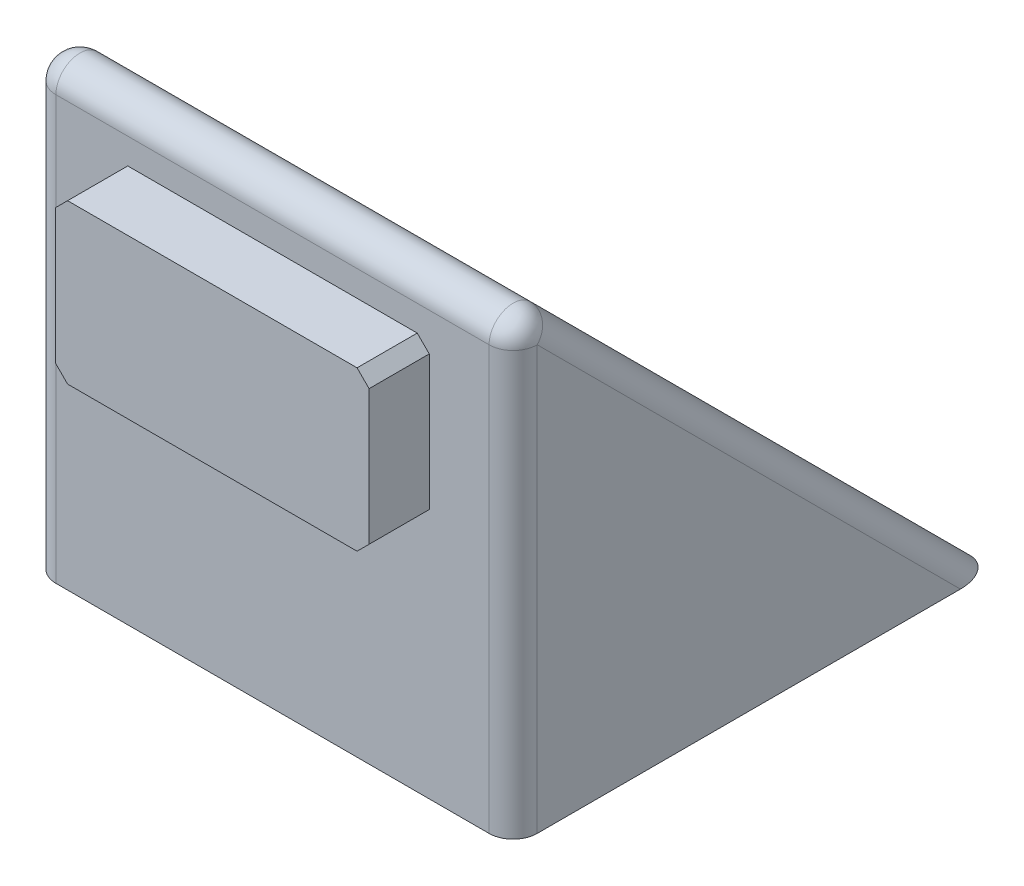
ISO-10303-21;
HEADER;
FILE_DESCRIPTION(('STEP AP214'),'2;1');
FILE_NAME('part.step','',(''),(''),'','','');
FILE_SCHEMA(('AUTOMOTIVE_DESIGN { 1 0 10303 214 1 1 1 1 }'));
ENDSEC;
DATA;
#1=APPLICATION_CONTEXT('core data for automotive mechanical design processes');
#2=APPLICATION_PROTOCOL_DEFINITION('international standard','automotive_design',2000,#1);
#3=PRODUCT_CONTEXT('',#1,'mechanical');
#4=PRODUCT('Part','Part','',(#3));
#5=PRODUCT_RELATED_PRODUCT_CATEGORY('part','',(#4));
#6=PRODUCT_DEFINITION_FORMATION('','',#4);
#7=PRODUCT_DEFINITION_CONTEXT('part definition',#1,'design');
#8=PRODUCT_DEFINITION('design','',#6,#7);
#9=PRODUCT_DEFINITION_SHAPE('','',#8);
#10=(LENGTH_UNIT() NAMED_UNIT(*) SI_UNIT(.MILLI.,.METRE.));
#11=(NAMED_UNIT(*) PLANE_ANGLE_UNIT() SI_UNIT($,.RADIAN.));
#12=(NAMED_UNIT(*) SI_UNIT($,.STERADIAN.) SOLID_ANGLE_UNIT());
#13=UNCERTAINTY_MEASURE_WITH_UNIT(LENGTH_MEASURE(1.E-05),#10,'distance_accuracy_value','');
#14=(GEOMETRIC_REPRESENTATION_CONTEXT(3) GLOBAL_UNCERTAINTY_ASSIGNED_CONTEXT((#13)) GLOBAL_UNIT_ASSIGNED_CONTEXT((#10,
#11,#12)) REPRESENTATION_CONTEXT('',''));
#15=CARTESIAN_POINT('',(0.,0.,0.));
#16=DIRECTION('',(0.,0.,1.));
#17=DIRECTION('',(1.,0.,0.));
#18=AXIS2_PLACEMENT_3D('',#15,#16,#17);
#19=CARTESIAN_POINT('',(-20.,40.,0.));
#20=DIRECTION('',(0.,0.,1.));
#21=DIRECTION('',(0.,-1.,0.));
#22=AXIS2_PLACEMENT_3D('',#19,#20,#21);
#23=PLANE('',#22);
#24=DIRECTION('',(0.,-1.,0.));
#25=VECTOR('',#24,1.);
#26=CARTESIAN_POINT('',(18.,40.,0.));
#27=LINE('',#26,#25);
#28=CARTESIAN_POINT('',(18.,0.,0.));
#29=VERTEX_POINT('',#28);
#30=CARTESIAN_POINT('',(18.,35.1715728752538,0.));
#31=VERTEX_POINT('',#30);
#32=EDGE_CURVE('E213',#29,#31,#27,.F.);
#33=ORIENTED_EDGE('',*,*,#32,.T.);
#34=DIRECTION('',(1.,0.,0.));
#35=VECTOR('',#34,1.);
#36=CARTESIAN_POINT('',(-20.,35.1715728752538,0.));
#37=LINE('',#36,#35);
#38=CARTESIAN_POINT('',(-18.,35.1715728752538,0.));
#39=VERTEX_POINT('',#38);
#40=EDGE_CURVE('E11',#31,#39,#37,.F.);
#41=ORIENTED_EDGE('',*,*,#40,.T.);
#42=DIRECTION('',(0.,-1.,0.));
#43=VECTOR('',#42,1.);
#44=CARTESIAN_POINT('',(-18.,0.,0.));
#45=LINE('',#44,#43);
#46=CARTESIAN_POINT('',(-18.,0.,0.));
#47=VERTEX_POINT('',#46);
#48=EDGE_CURVE('E211',#39,#47,#45,.T.);
#49=ORIENTED_EDGE('',*,*,#48,.T.);
#50=DIRECTION('',(1.,0.,0.));
#51=VECTOR('',#50,1.);
#52=CARTESIAN_POINT('',(-20.,0.,0.));
#53=LINE('',#52,#51);
#54=EDGE_CURVE('E183',#47,#29,#53,.T.);
#55=ORIENTED_EDGE('',*,*,#54,.T.);
#56=EDGE_LOOP('',(#33,#41,#49,#55));
#57=FACE_BOUND('',#56,.T.);
#58=DIRECTION('',(-0.707106781186547,-0.707106781186547,0.));
#59=VECTOR('',#58,1.);
#60=CARTESIAN_POINT('',(-13.0285883481844,32.0285883481845,0.));
#61=LINE('',#60,#59);
#62=CARTESIAN_POINT('',(-12.0285883481844,33.0285883481845,0.));
#63=VERTEX_POINT('',#62);
#64=CARTESIAN_POINT('',(-13.0285883481844,32.0285883481845,0.));
#65=VERTEX_POINT('',#64);
#66=EDGE_CURVE('E232',#63,#65,#61,.T.);
#67=ORIENTED_EDGE('',*,*,#66,.F.);
#68=DIRECTION('',(-1.,0.,0.));
#69=VECTOR('',#68,1.);
#70=CARTESIAN_POINT('',(-12.0285883481844,33.0285883481845,0.));
#71=LINE('',#70,#69);
#72=CARTESIAN_POINT('',(12.0285883481844,33.0285883481845,0.));
#73=VERTEX_POINT('',#72);
#74=EDGE_CURVE('E170',#73,#63,#71,.T.);
#75=ORIENTED_EDGE('',*,*,#74,.F.);
#76=DIRECTION('',(-0.707106781186547,0.707106781186547,0.));
#77=VECTOR('',#76,1.);
#78=CARTESIAN_POINT('',(12.0285883481844,33.0285883481845,0.));
#79=LINE('',#78,#77);
#80=CARTESIAN_POINT('',(13.0285883481844,32.0285883481845,0.));
#81=VERTEX_POINT('',#80);
#82=EDGE_CURVE('E166',#81,#73,#79,.T.);
#83=ORIENTED_EDGE('',*,*,#82,.F.);
#84=DIRECTION('',(0.,1.,0.));
#85=VECTOR('',#84,1.);
#86=CARTESIAN_POINT('',(13.0285883481844,32.0285883481845,0.));
#87=LINE('',#86,#85);
#88=CARTESIAN_POINT('',(13.0285883481844,20.8278160130197,0.));
#89=VERTEX_POINT('',#88);
#90=EDGE_CURVE('E246',#89,#81,#87,.T.);
#91=ORIENTED_EDGE('',*,*,#90,.F.);
#92=DIRECTION('',(0.707106781186547,0.707106781186547,0.));
#93=VECTOR('',#92,1.);
#94=CARTESIAN_POINT('',(13.0285883481844,20.8278160130197,0.));
#95=LINE('',#94,#93);
#96=CARTESIAN_POINT('',(12.0285883481844,19.8278160130197,0.));
#97=VERTEX_POINT('',#96);
#98=EDGE_CURVE('E244',#97,#89,#95,.T.);
#99=ORIENTED_EDGE('',*,*,#98,.F.);
#100=DIRECTION('',(1.,0.,0.));
#101=VECTOR('',#100,1.);
#102=CARTESIAN_POINT('',(-12.0285883481844,19.8278160130197,0.));
#103=LINE('',#102,#101);
#104=CARTESIAN_POINT('',(-12.0285883481844,19.8278160130197,0.));
#105=VERTEX_POINT('',#104);
#106=EDGE_CURVE('E242',#105,#97,#103,.T.);
#107=ORIENTED_EDGE('',*,*,#106,.F.);
#108=DIRECTION('',(0.707106781186547,-0.707106781186547,0.));
#109=VECTOR('',#108,1.);
#110=CARTESIAN_POINT('',(-13.0285883481844,20.8278160130197,0.));
#111=LINE('',#110,#109);
#112=CARTESIAN_POINT('',(-13.0285883481844,20.8278160130197,0.));
#113=VERTEX_POINT('',#112);
#114=EDGE_CURVE('E240',#113,#105,#111,.T.);
#115=ORIENTED_EDGE('',*,*,#114,.F.);
#116=DIRECTION('',(0.,-1.,0.));
#117=VECTOR('',#116,1.);
#118=CARTESIAN_POINT('',(-13.0285883481844,32.0285883481845,0.));
#119=LINE('',#118,#117);
#120=EDGE_CURVE('E234',#65,#113,#119,.T.);
#121=ORIENTED_EDGE('',*,*,#120,.F.);
#122=EDGE_LOOP('',(#67,#75,#83,#91,#99,#107,#115,#121));
#123=FACE_BOUND('',#122,.T.);
#124=ADVANCED_FACE('F37',(#57,#123),#23,.T.);
#125=CARTESIAN_POINT('',(-20.,0.,-40.));
#126=DIRECTION('',(0.,0.707106781186548,-0.707106781186548));
#127=DIRECTION('',(0.,0.707106781186548,0.707106781186548));
#128=AXIS2_PLACEMENT_3D('',#125,#126,#127);
#129=PLANE('',#128);
#130=DIRECTION('',(0.,0.707106781186548,0.707106781186548));
#131=VECTOR('',#130,1.);
#132=CARTESIAN_POINT('',(-18.,40.,0.));
#133=LINE('',#132,#131);
#134=CARTESIAN_POINT('',(-18.,0.,-40.));
#135=VERTEX_POINT('',#134);
#136=CARTESIAN_POINT('',(-18.,36.5857864376269,-3.4142135623731));
#137=VERTEX_POINT('',#136);
#138=EDGE_CURVE('E194',#135,#137,#133,.T.);
#139=ORIENTED_EDGE('',*,*,#138,.T.);
#140=DIRECTION('',(1.,0.,0.));
#141=VECTOR('',#140,1.);
#142=CARTESIAN_POINT('',(-20.,36.5857864376269,-3.4142135623731));
#143=LINE('',#142,#141);
#144=CARTESIAN_POINT('',(18.,36.5857864376269,-3.41421356237309));
#145=VERTEX_POINT('',#144);
#146=EDGE_CURVE('E46',#137,#145,#143,.T.);
#147=ORIENTED_EDGE('',*,*,#146,.T.);
#148=DIRECTION('',(0.,0.707106781186548,0.707106781186548));
#149=VECTOR('',#148,1.);
#150=CARTESIAN_POINT('',(18.,0.,-40.));
#151=LINE('',#150,#149);
#152=CARTESIAN_POINT('',(18.,0.,-40.));
#153=VERTEX_POINT('',#152);
#154=EDGE_CURVE('E196',#145,#153,#151,.F.);
#155=ORIENTED_EDGE('',*,*,#154,.T.);
#156=DIRECTION('',(1.,0.,0.));
#157=VECTOR('',#156,1.);
#158=CARTESIAN_POINT('',(-20.,0.,-40.));
#159=LINE('',#158,#157);
#160=EDGE_CURVE('E184',#135,#153,#159,.T.);
#161=ORIENTED_EDGE('',*,*,#160,.F.);
#162=EDGE_LOOP('',(#139,#147,#155,#161));
#163=FACE_BOUND('',#162,.T.);
#164=ADVANCED_FACE('F302',(#163),#129,.T.);
#165=CARTESIAN_POINT('',(-20.,0.,0.));
#166=DIRECTION('',(0.,-1.,0.));
#167=DIRECTION('',(0.,0.,-1.));
#168=AXIS2_PLACEMENT_3D('',#165,#166,#167);
#169=PLANE('',#168);
#170=ORIENTED_EDGE('',*,*,#160,.T.);
#171=CARTESIAN_POINT('',(18.,0.,-37.1715728752538));
#172=DIRECTION('',(0.,-1.,0.));
#173=DIRECTION('',(0.,0.,1.));
#174=AXIS2_PLACEMENT_3D('',#171,#172,#173);
#175=ELLIPSE('',#174,2.82842712474619,2.);
#176=CARTESIAN_POINT('',(20.,0.,-37.1715728752538));
#177=VERTEX_POINT('',#176);
#178=EDGE_CURVE('E204',#153,#177,#175,.T.);
#179=ORIENTED_EDGE('',*,*,#178,.T.);
#180=DIRECTION('',(0.,0.,-1.));
#181=VECTOR('',#180,1.);
#182=CARTESIAN_POINT('',(20.,0.,0.));
#183=LINE('',#182,#181);
#184=CARTESIAN_POINT('',(20.,0.,-2.));
#185=VERTEX_POINT('',#184);
#186=EDGE_CURVE('E172',#185,#177,#183,.T.);
#187=ORIENTED_EDGE('',*,*,#186,.F.);
#188=CARTESIAN_POINT('',(18.,0.,-2.));
#189=DIRECTION('',(0.,-1.,0.));
#190=DIRECTION('',(0.,0.,-1.));
#191=AXIS2_PLACEMENT_3D('',#188,#189,#190);
#192=CIRCLE('',#191,2.);
#193=EDGE_CURVE('E200',#185,#29,#192,.T.);
#194=ORIENTED_EDGE('',*,*,#193,.T.);
#195=ORIENTED_EDGE('',*,*,#54,.F.);
#196=CARTESIAN_POINT('',(-18.,0.,-2.));
#197=DIRECTION('',(0.,-1.,0.));
#198=DIRECTION('',(0.,0.,-1.));
#199=AXIS2_PLACEMENT_3D('',#196,#197,#198);
#200=CIRCLE('',#199,2.);
#201=CARTESIAN_POINT('',(-20.,0.,-2.));
#202=VERTEX_POINT('',#201);
#203=EDGE_CURVE('E198',#47,#202,#200,.T.);
#204=ORIENTED_EDGE('',*,*,#203,.T.);
#205=DIRECTION('',(0.,0.,-1.));
#206=VECTOR('',#205,1.);
#207=CARTESIAN_POINT('',(-20.,0.,0.));
#208=LINE('',#207,#206);
#209=CARTESIAN_POINT('',(-20.,0.,-37.1715728752538));
#210=VERTEX_POINT('',#209);
#211=EDGE_CURVE('E175',#202,#210,#208,.T.);
#212=ORIENTED_EDGE('',*,*,#211,.T.);
#213=CARTESIAN_POINT('',(-18.,0.,-37.1715728752538));
#214=DIRECTION('',(0.,-1.,0.));
#215=DIRECTION('',(0.,0.,-1.));
#216=AXIS2_PLACEMENT_3D('',#213,#214,#215);
#217=ELLIPSE('',#216,2.82842712474619,2.);
#218=EDGE_CURVE('E202',#210,#135,#217,.T.);
#219=ORIENTED_EDGE('',*,*,#218,.T.);
#220=EDGE_LOOP('',(#170,#179,#187,#194,#195,#204,#212,#219));
#221=FACE_BOUND('',#220,.T.);
#222=ADVANCED_FACE('F308',(#221),#169,.T.);
#223=CARTESIAN_POINT('',(-20.,0.,0.));
#224=DIRECTION('',(1.,0.,0.));
#225=DIRECTION('',(0.,0.,-1.));
#226=AXIS2_PLACEMENT_3D('',#223,#224,#225);
#227=PLANE('',#226);
#228=DIRECTION('',(0.,-1.,0.));
#229=VECTOR('',#228,1.);
#230=CARTESIAN_POINT('',(-20.,40.,-2.));
#231=LINE('',#230,#229);
#232=CARTESIAN_POINT('',(-20.,35.1715728752538,-2.));
#233=VERTEX_POINT('',#232);
#234=EDGE_CURVE('E206',#202,#233,#231,.F.);
#235=ORIENTED_EDGE('',*,*,#234,.T.);
#236=DIRECTION('',(0.,0.707106781186548,0.707106781186548));
#237=VECTOR('',#236,1.);
#238=CARTESIAN_POINT('',(-20.,-1.4142135623731,-38.5857864376269));
#239=LINE('',#238,#237);
#240=EDGE_CURVE('E209',#233,#210,#239,.F.);
#241=ORIENTED_EDGE('',*,*,#240,.T.);
#242=ORIENTED_EDGE('',*,*,#211,.F.);
#243=EDGE_LOOP('',(#235,#241,#242));
#244=FACE_BOUND('',#243,.T.);
#245=ADVANCED_FACE('F355',(#244),#227,.F.);
#246=CARTESIAN_POINT('',(20.,0.,0.));
#247=DIRECTION('',(1.,0.,0.));
#248=DIRECTION('',(0.,0.,-1.));
#249=AXIS2_PLACEMENT_3D('',#246,#247,#248);
#250=PLANE('',#249);
#251=ORIENTED_EDGE('',*,*,#186,.T.);
#252=DIRECTION('',(0.,0.707106781186548,0.707106781186548));
#253=VECTOR('',#252,1.);
#254=CARTESIAN_POINT('',(20.,18.5857864376269,-18.5857864376269));
#255=LINE('',#254,#253);
#256=CARTESIAN_POINT('',(20.,35.1715728752538,-2.));
#257=VERTEX_POINT('',#256);
#258=EDGE_CURVE('E191',#177,#257,#255,.T.);
#259=ORIENTED_EDGE('',*,*,#258,.T.);
#260=DIRECTION('',(0.,-1.,0.));
#261=VECTOR('',#260,1.);
#262=CARTESIAN_POINT('',(20.,0.,-2.));
#263=LINE('',#262,#261);
#264=EDGE_CURVE('E187',#257,#185,#263,.T.);
#265=ORIENTED_EDGE('',*,*,#264,.T.);
#266=EDGE_LOOP('',(#251,#259,#265));
#267=FACE_BOUND('',#266,.T.);
#268=ADVANCED_FACE('F351',(#267),#250,.T.);
#269=CARTESIAN_POINT('',(-12.0285883481844,33.0285883481845,5.));
#270=DIRECTION('',(0.,-1.,0.));
#271=DIRECTION('',(0.,0.,-1.));
#272=AXIS2_PLACEMENT_3D('',#269,#270,#271);
#273=PLANE('',#272);
#274=ORIENTED_EDGE('',*,*,#74,.T.);
#275=DIRECTION('',(0.,0.,-1.));
#276=VECTOR('',#275,1.);
#277=CARTESIAN_POINT('',(-12.0285883481844,33.0285883481845,5.));
#278=LINE('',#277,#276);
#279=CARTESIAN_POINT('',(-12.0285883481844,33.0285883481845,5.));
#280=VERTEX_POINT('',#279);
#281=EDGE_CURVE('E150',#280,#63,#278,.T.);
#282=ORIENTED_EDGE('',*,*,#281,.F.);
#283=DIRECTION('',(-1.,0.,0.));
#284=VECTOR('',#283,1.);
#285=CARTESIAN_POINT('',(-12.0285883481844,33.0285883481845,5.));
#286=LINE('',#285,#284);
#287=CARTESIAN_POINT('',(12.0285883481844,33.0285883481845,5.));
#288=VERTEX_POINT('',#287);
#289=EDGE_CURVE('E157',#288,#280,#286,.T.);
#290=ORIENTED_EDGE('',*,*,#289,.F.);
#291=DIRECTION('',(0.,0.,-1.));
#292=VECTOR('',#291,1.);
#293=CARTESIAN_POINT('',(12.0285883481844,33.0285883481845,5.));
#294=LINE('',#293,#292);
#295=EDGE_CURVE('E250',#288,#73,#294,.T.);
#296=ORIENTED_EDGE('',*,*,#295,.T.);
#297=EDGE_LOOP('',(#274,#282,#290,#296));
#298=FACE_BOUND('',#297,.T.);
#299=ADVANCED_FACE('F168',(#298),#273,.F.);
#300=CARTESIAN_POINT('',(-13.0285883481844,32.0285883481845,5.));
#301=DIRECTION('',(0.707106781186548,-0.707106781186548,0.));
#302=DIRECTION('',(0.707106781186548,0.707106781186548,0.));
#303=AXIS2_PLACEMENT_3D('',#300,#301,#302);
#304=PLANE('',#303);
#305=ORIENTED_EDGE('',*,*,#66,.T.);
#306=DIRECTION('',(0.,0.,-1.));
#307=VECTOR('',#306,1.);
#308=CARTESIAN_POINT('',(-13.0285883481844,32.0285883481845,5.));
#309=LINE('',#308,#307);
#310=CARTESIAN_POINT('',(-13.0285883481844,32.0285883481845,5.));
#311=VERTEX_POINT('',#310);
#312=EDGE_CURVE('E153',#311,#65,#309,.T.);
#313=ORIENTED_EDGE('',*,*,#312,.F.);
#314=DIRECTION('',(-0.707106781186547,-0.707106781186547,0.));
#315=VECTOR('',#314,1.);
#316=CARTESIAN_POINT('',(-13.0285883481844,32.0285883481845,5.));
#317=LINE('',#316,#315);
#318=EDGE_CURVE('E146',#280,#311,#317,.T.);
#319=ORIENTED_EDGE('',*,*,#318,.F.);
#320=ORIENTED_EDGE('',*,*,#281,.T.);
#321=EDGE_LOOP('',(#305,#313,#319,#320));
#322=FACE_BOUND('',#321,.T.);
#323=ADVANCED_FACE('F148',(#322),#304,.F.);
#324=CARTESIAN_POINT('',(-13.0285883481844,32.0285883481845,5.));
#325=DIRECTION('',(1.,0.,0.));
#326=DIRECTION('',(0.,0.,-1.));
#327=AXIS2_PLACEMENT_3D('',#324,#325,#326);
#328=PLANE('',#327);
#329=ORIENTED_EDGE('',*,*,#120,.T.);
#330=DIRECTION('',(0.,0.,-1.));
#331=VECTOR('',#330,1.);
#332=CARTESIAN_POINT('',(-13.0285883481844,20.8278160130197,5.));
#333=LINE('',#332,#331);
#334=CARTESIAN_POINT('',(-13.0285883481844,20.8278160130197,5.));
#335=VERTEX_POINT('',#334);
#336=EDGE_CURVE('E177',#335,#113,#333,.T.);
#337=ORIENTED_EDGE('',*,*,#336,.F.);
#338=DIRECTION('',(0.,-1.,0.));
#339=VECTOR('',#338,1.);
#340=CARTESIAN_POINT('',(-13.0285883481844,32.0285883481845,5.));
#341=LINE('',#340,#339);
#342=EDGE_CURVE('E156',#311,#335,#341,.T.);
#343=ORIENTED_EDGE('',*,*,#342,.F.);
#344=ORIENTED_EDGE('',*,*,#312,.T.);
#345=EDGE_LOOP('',(#329,#337,#343,#344));
#346=FACE_BOUND('',#345,.T.);
#347=ADVANCED_FACE('F292',(#346),#328,.F.);
#348=CARTESIAN_POINT('',(-13.0285883481844,20.8278160130197,5.));
#349=DIRECTION('',(0.707106781186548,0.707106781186548,0.));
#350=DIRECTION('',(-0.707106781186548,0.707106781186548,0.));
#351=AXIS2_PLACEMENT_3D('',#348,#349,#350);
#352=PLANE('',#351);
#353=ORIENTED_EDGE('',*,*,#114,.T.);
#354=DIRECTION('',(0.,0.,-1.));
#355=VECTOR('',#354,1.);
#356=CARTESIAN_POINT('',(-12.0285883481844,19.8278160130197,5.));
#357=LINE('',#356,#355);
#358=CARTESIAN_POINT('',(-12.0285883481844,19.8278160130197,5.));
#359=VERTEX_POINT('',#358);
#360=EDGE_CURVE('E260',#359,#105,#357,.T.);
#361=ORIENTED_EDGE('',*,*,#360,.F.);
#362=DIRECTION('',(0.707106781186547,-0.707106781186547,0.));
#363=VECTOR('',#362,1.);
#364=CARTESIAN_POINT('',(-13.0285883481844,20.8278160130197,5.));
#365=LINE('',#364,#363);
#366=EDGE_CURVE('E269',#335,#359,#365,.T.);
#367=ORIENTED_EDGE('',*,*,#366,.F.);
#368=ORIENTED_EDGE('',*,*,#336,.T.);
#369=EDGE_LOOP('',(#353,#361,#367,#368));
#370=FACE_BOUND('',#369,.T.);
#371=ADVANCED_FACE('F267',(#370),#352,.F.);
#372=CARTESIAN_POINT('',(-12.0285883481844,19.8278160130197,5.));
#373=DIRECTION('',(0.,1.,0.));
#374=DIRECTION('',(-1.,0.,0.));
#375=AXIS2_PLACEMENT_3D('',#372,#373,#374);
#376=PLANE('',#375);
#377=ORIENTED_EDGE('',*,*,#106,.T.);
#378=DIRECTION('',(0.,0.,-1.));
#379=VECTOR('',#378,1.);
#380=CARTESIAN_POINT('',(12.0285883481844,19.8278160130197,5.));
#381=LINE('',#380,#379);
#382=CARTESIAN_POINT('',(12.0285883481844,19.8278160130197,5.));
#383=VERTEX_POINT('',#382);
#384=EDGE_CURVE('E257',#383,#97,#381,.T.);
#385=ORIENTED_EDGE('',*,*,#384,.F.);
#386=DIRECTION('',(1.,0.,0.));
#387=VECTOR('',#386,1.);
#388=CARTESIAN_POINT('',(-12.0285883481844,19.8278160130197,5.));
#389=LINE('',#388,#387);
#390=EDGE_CURVE('E287',#359,#383,#389,.T.);
#391=ORIENTED_EDGE('',*,*,#390,.F.);
#392=ORIENTED_EDGE('',*,*,#360,.T.);
#393=EDGE_LOOP('',(#377,#385,#391,#392));
#394=FACE_BOUND('',#393,.T.);
#395=ADVANCED_FACE('F278',(#394),#376,.F.);
#396=CARTESIAN_POINT('',(13.0285883481844,20.8278160130197,5.));
#397=DIRECTION('',(-0.707106781186548,0.707106781186548,0.));
#398=DIRECTION('',(-0.707106781186548,-0.707106781186548,0.));
#399=AXIS2_PLACEMENT_3D('',#396,#397,#398);
#400=PLANE('',#399);
#401=ORIENTED_EDGE('',*,*,#98,.T.);
#402=DIRECTION('',(0.,0.,-1.));
#403=VECTOR('',#402,1.);
#404=CARTESIAN_POINT('',(13.0285883481844,20.8278160130197,5.));
#405=LINE('',#404,#403);
#406=CARTESIAN_POINT('',(13.0285883481844,20.8278160130197,5.));
#407=VERTEX_POINT('',#406);
#408=EDGE_CURVE('E254',#407,#89,#405,.T.);
#409=ORIENTED_EDGE('',*,*,#408,.F.);
#410=DIRECTION('',(0.707106781186547,0.707106781186547,0.));
#411=VECTOR('',#410,1.);
#412=CARTESIAN_POINT('',(13.0285883481844,20.8278160130197,5.));
#413=LINE('',#412,#411);
#414=EDGE_CURVE('E284',#383,#407,#413,.T.);
#415=ORIENTED_EDGE('',*,*,#414,.F.);
#416=ORIENTED_EDGE('',*,*,#384,.T.);
#417=EDGE_LOOP('',(#401,#409,#415,#416));
#418=FACE_BOUND('',#417,.T.);
#419=ADVANCED_FACE('F282',(#418),#400,.F.);
#420=CARTESIAN_POINT('',(13.0285883481844,32.0285883481845,5.));
#421=DIRECTION('',(-1.,0.,0.));
#422=DIRECTION('',(0.,0.,1.));
#423=AXIS2_PLACEMENT_3D('',#420,#421,#422);
#424=PLANE('',#423);
#425=ORIENTED_EDGE('',*,*,#90,.T.);
#426=DIRECTION('',(0.,0.,-1.));
#427=VECTOR('',#426,1.);
#428=CARTESIAN_POINT('',(13.0285883481844,32.0285883481845,5.));
#429=LINE('',#428,#427);
#430=CARTESIAN_POINT('',(13.0285883481844,32.0285883481845,5.));
#431=VERTEX_POINT('',#430);
#432=EDGE_CURVE('E252',#431,#81,#429,.T.);
#433=ORIENTED_EDGE('',*,*,#432,.F.);
#434=DIRECTION('',(0.,1.,0.));
#435=VECTOR('',#434,1.);
#436=CARTESIAN_POINT('',(13.0285883481844,32.0285883481845,5.));
#437=LINE('',#436,#435);
#438=EDGE_CURVE('E286',#407,#431,#437,.T.);
#439=ORIENTED_EDGE('',*,*,#438,.F.);
#440=ORIENTED_EDGE('',*,*,#408,.T.);
#441=EDGE_LOOP('',(#425,#433,#439,#440));
#442=FACE_BOUND('',#441,.T.);
#443=ADVANCED_FACE('F406',(#442),#424,.F.);
#444=CARTESIAN_POINT('',(12.0285883481844,33.0285883481845,5.));
#445=DIRECTION('',(-0.707106781186548,-0.707106781186548,0.));
#446=DIRECTION('',(0.707106781186548,-0.707106781186548,0.));
#447=AXIS2_PLACEMENT_3D('',#444,#445,#446);
#448=PLANE('',#447);
#449=ORIENTED_EDGE('',*,*,#82,.T.);
#450=ORIENTED_EDGE('',*,*,#295,.F.);
#451=DIRECTION('',(-0.707106781186547,0.707106781186547,0.));
#452=VECTOR('',#451,1.);
#453=CARTESIAN_POINT('',(12.0285883481844,33.0285883481845,5.));
#454=LINE('',#453,#452);
#455=EDGE_CURVE('E162',#431,#288,#454,.T.);
#456=ORIENTED_EDGE('',*,*,#455,.F.);
#457=ORIENTED_EDGE('',*,*,#432,.T.);
#458=EDGE_LOOP('',(#449,#450,#456,#457));
#459=FACE_BOUND('',#458,.T.);
#460=ADVANCED_FACE('F415',(#459),#448,.F.);
#461=CARTESIAN_POINT('',(0.,0.,5.));
#462=DIRECTION('',(0.,0.,-1.));
#463=DIRECTION('',(-1.,0.,0.));
#464=AXIS2_PLACEMENT_3D('',#461,#462,#463);
#465=PLANE('',#464);
#466=ORIENTED_EDGE('',*,*,#289,.T.);
#467=ORIENTED_EDGE('',*,*,#318,.T.);
#468=ORIENTED_EDGE('',*,*,#342,.T.);
#469=ORIENTED_EDGE('',*,*,#366,.T.);
#470=ORIENTED_EDGE('',*,*,#390,.T.);
#471=ORIENTED_EDGE('',*,*,#414,.T.);
#472=ORIENTED_EDGE('',*,*,#438,.T.);
#473=ORIENTED_EDGE('',*,*,#455,.T.);
#474=EDGE_LOOP('',(#466,#467,#468,#469,#470,#471,#472,#473));
#475=FACE_BOUND('',#474,.T.);
#476=ADVANCED_FACE('F160',(#475),#465,.F.);
#477=CARTESIAN_POINT('',(18.,0.,-2.));
#478=DIRECTION('',(0.,-1.,0.));
#479=DIRECTION('',(0.,0.,-1.));
#480=AXIS2_PLACEMENT_3D('',#477,#478,#479);
#481=CYLINDRICAL_SURFACE('',#480,2.);
#482=ORIENTED_EDGE('',*,*,#264,.F.);
#483=CARTESIAN_POINT('',(18.,35.1715728752538,-2.));
#484=DIRECTION('',(0.,-1.,0.));
#485=DIRECTION('',(0.,0.,-1.));
#486=AXIS2_PLACEMENT_3D('',#483,#484,#485);
#487=CIRCLE('',#486,2.);
#488=EDGE_CURVE('E54',#257,#31,#487,.T.);
#489=ORIENTED_EDGE('',*,*,#488,.T.);
#490=ORIENTED_EDGE('',*,*,#32,.F.);
#491=ORIENTED_EDGE('',*,*,#193,.F.);
#492=EDGE_LOOP('',(#482,#489,#490,#491));
#493=FACE_BOUND('',#492,.T.);
#494=ADVANCED_FACE('F316',(#493),#481,.T.);
#495=CARTESIAN_POINT('',(18.,18.5857864376269,-18.5857864376269));
#496=DIRECTION('',(0.,0.707106781186548,0.707106781186548));
#497=DIRECTION('',(0.,-0.707106781186548,0.707106781186548));
#498=AXIS2_PLACEMENT_3D('',#495,#496,#497);
#499=CYLINDRICAL_SURFACE('',#498,2.);
#500=ORIENTED_EDGE('',*,*,#154,.F.);
#501=CARTESIAN_POINT('',(18.,35.1715728752538,-2.00000000000001));
#502=DIRECTION('',(0.,0.707106781186548,0.707106781186548));
#503=DIRECTION('',(0.,-0.707106781186548,0.707106781186548));
#504=AXIS2_PLACEMENT_3D('',#501,#502,#503);
#505=CIRCLE('',#504,2.);
#506=EDGE_CURVE('E220',#145,#257,#505,.F.);
#507=ORIENTED_EDGE('',*,*,#506,.T.);
#508=ORIENTED_EDGE('',*,*,#258,.F.);
#509=ORIENTED_EDGE('',*,*,#178,.F.);
#510=EDGE_LOOP('',(#500,#507,#508,#509));
#511=FACE_BOUND('',#510,.T.);
#512=ADVANCED_FACE('F312',(#511),#499,.T.);
#513=CARTESIAN_POINT('',(-18.,40.,-2.));
#514=DIRECTION('',(0.,1.,0.));
#515=DIRECTION('',(0.,0.,1.));
#516=AXIS2_PLACEMENT_3D('',#513,#514,#515);
#517=CYLINDRICAL_SURFACE('',#516,2.);
#518=ORIENTED_EDGE('',*,*,#48,.F.);
#519=CARTESIAN_POINT('',(-18.,35.1715728752538,-2.));
#520=DIRECTION('',(0.,1.,0.));
#521=DIRECTION('',(0.,0.,1.));
#522=AXIS2_PLACEMENT_3D('',#519,#520,#521);
#523=CIRCLE('',#522,2.);
#524=EDGE_CURVE('E218',#39,#233,#523,.F.);
#525=ORIENTED_EDGE('',*,*,#524,.T.);
#526=ORIENTED_EDGE('',*,*,#234,.F.);
#527=ORIENTED_EDGE('',*,*,#203,.F.);
#528=EDGE_LOOP('',(#518,#525,#526,#527));
#529=FACE_BOUND('',#528,.T.);
#530=ADVANCED_FACE('F315',(#529),#517,.T.);
#531=CARTESIAN_POINT('',(-18.,-1.4142135623731,-38.5857864376269));
#532=DIRECTION('',(0.,-0.707106781186548,-0.707106781186548));
#533=DIRECTION('',(0.,0.707106781186548,-0.707106781186548));
#534=AXIS2_PLACEMENT_3D('',#531,#532,#533);
#535=CYLINDRICAL_SURFACE('',#534,2.);
#536=ORIENTED_EDGE('',*,*,#240,.F.);
#537=CARTESIAN_POINT('',(-18.,35.1715728752538,-2.));
#538=DIRECTION('',(0.,-0.707106781186548,-0.707106781186548));
#539=DIRECTION('',(0.,0.707106781186548,-0.707106781186548));
#540=AXIS2_PLACEMENT_3D('',#537,#538,#539);
#541=CIRCLE('',#540,2.);
#542=EDGE_CURVE('E215',#233,#137,#541,.T.);
#543=ORIENTED_EDGE('',*,*,#542,.T.);
#544=ORIENTED_EDGE('',*,*,#138,.F.);
#545=ORIENTED_EDGE('',*,*,#218,.F.);
#546=EDGE_LOOP('',(#536,#543,#544,#545));
#547=FACE_BOUND('',#546,.T.);
#548=ADVANCED_FACE('F320',(#547),#535,.T.);
#549=CARTESIAN_POINT('',(18.,35.1715728752538,-2.));
#550=DIRECTION('',(0.,0.,1.));
#551=DIRECTION('',(1.,0.,0.));
#552=AXIS2_PLACEMENT_3D('',#549,#550,#551);
#553=SPHERICAL_SURFACE('',#552,2.);
#554=ORIENTED_EDGE('',*,*,#488,.F.);
#555=ORIENTED_EDGE('',*,*,#506,.F.);
#556=CARTESIAN_POINT('',(18.,35.1715728752538,-2.));
#557=DIRECTION('',(-1.,0.,0.));
#558=DIRECTION('',(0.,-1.,0.));
#559=AXIS2_PLACEMENT_3D('',#556,#557,#558);
#560=CIRCLE('',#559,2.);
#561=EDGE_CURVE('E41',#31,#145,#560,.T.);
#562=ORIENTED_EDGE('',*,*,#561,.F.);
#563=EDGE_LOOP('',(#554,#555,#562));
#564=FACE_BOUND('',#563,.T.);
#565=ADVANCED_FACE('F39',(#564),#553,.T.);
#566=CARTESIAN_POINT('',(-20.,35.1715728752538,-2.));
#567=DIRECTION('',(1.,0.,0.));
#568=DIRECTION('',(0.,0.,-1.));
#569=AXIS2_PLACEMENT_3D('',#566,#567,#568);
#570=CYLINDRICAL_SURFACE('',#569,2.);
#571=ORIENTED_EDGE('',*,*,#561,.T.);
#572=ORIENTED_EDGE('',*,*,#146,.F.);
#573=CARTESIAN_POINT('',(-18.,35.1715728752538,-2.));
#574=DIRECTION('',(-1.,0.,0.));
#575=DIRECTION('',(0.,0.,1.));
#576=AXIS2_PLACEMENT_3D('',#573,#574,#575);
#577=CIRCLE('',#576,2.);
#578=EDGE_CURVE('E223',#39,#137,#577,.T.);
#579=ORIENTED_EDGE('',*,*,#578,.F.);
#580=ORIENTED_EDGE('',*,*,#40,.F.);
#581=EDGE_LOOP('',(#571,#572,#579,#580));
#582=FACE_BOUND('',#581,.T.);
#583=ADVANCED_FACE('F329',(#582),#570,.T.);
#584=CARTESIAN_POINT('',(-18.,35.1715728752538,-2.));
#585=DIRECTION('',(0.,0.,1.));
#586=DIRECTION('',(1.,0.,0.));
#587=AXIS2_PLACEMENT_3D('',#584,#585,#586);
#588=SPHERICAL_SURFACE('',#587,2.);
#589=ORIENTED_EDGE('',*,*,#542,.F.);
#590=ORIENTED_EDGE('',*,*,#524,.F.);
#591=ORIENTED_EDGE('',*,*,#578,.T.);
#592=EDGE_LOOP('',(#589,#590,#591));
#593=FACE_BOUND('',#592,.T.);
#594=ADVANCED_FACE('F327',(#593),#588,.T.);
#595=CLOSED_SHELL('',(#124,#164,#222,#245,#268,#299,#323,#347,#371,#395,#419,#443,#460,#476,
#494,#512,#530,#548,#565,#583,#594));
#596=MANIFOLD_SOLID_BREP('B2',#595);
#597=ADVANCED_BREP_SHAPE_REPRESENTATION('',(#18,#596),#14);
#598=SHAPE_DEFINITION_REPRESENTATION(#9,#597);
ENDSEC;
END-ISO-10303-21;
